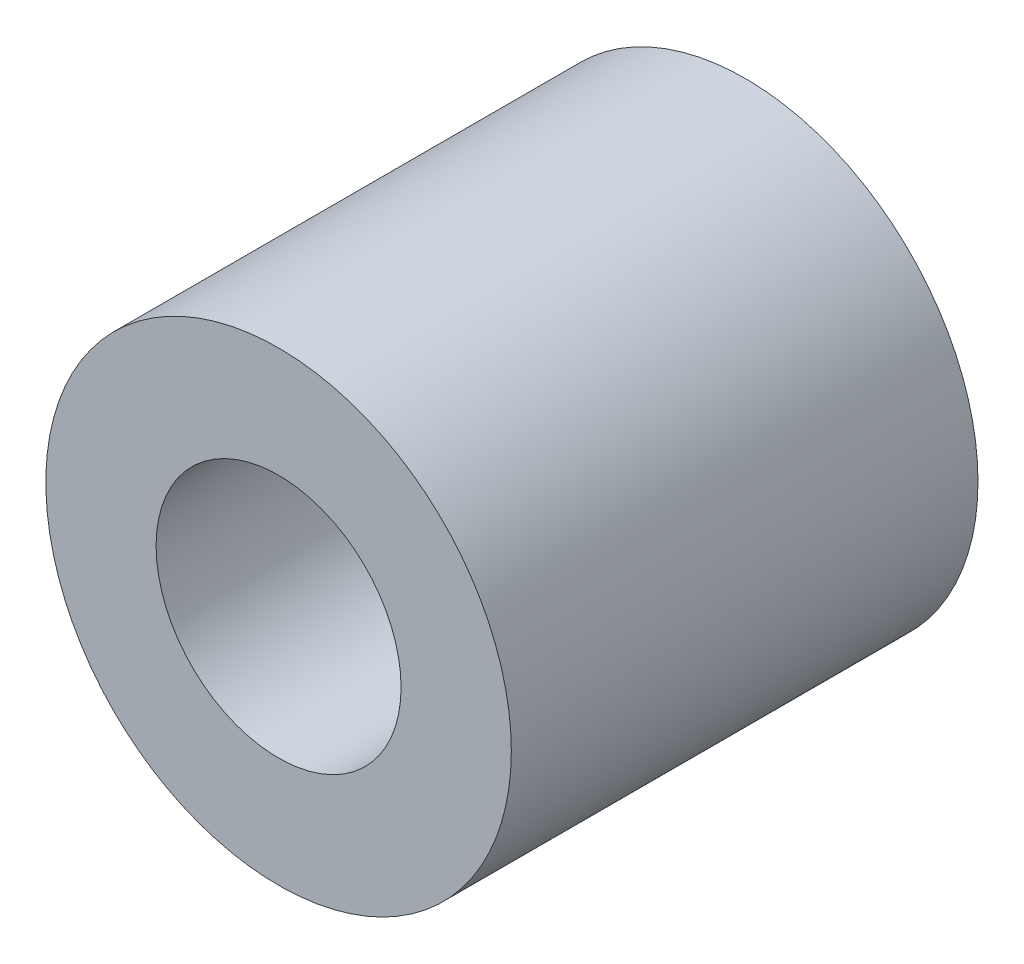
ISO-10303-21;
HEADER;
FILE_DESCRIPTION(('STEP AP214'),'2;1');
FILE_NAME('part.step','',(''),(''),'','','');
FILE_SCHEMA(('AUTOMOTIVE_DESIGN { 1 0 10303 214 1 1 1 1 }'));
ENDSEC;
DATA;
#1=APPLICATION_CONTEXT('core data for automotive mechanical design processes');
#2=APPLICATION_PROTOCOL_DEFINITION('international standard','automotive_design',2000,#1);
#3=PRODUCT_CONTEXT('',#1,'mechanical');
#4=PRODUCT('Part','Part','',(#3));
#5=PRODUCT_RELATED_PRODUCT_CATEGORY('part','',(#4));
#6=PRODUCT_DEFINITION_FORMATION('','',#4);
#7=PRODUCT_DEFINITION_CONTEXT('part definition',#1,'design');
#8=PRODUCT_DEFINITION('design','',#6,#7);
#9=PRODUCT_DEFINITION_SHAPE('','',#8);
#10=(LENGTH_UNIT() NAMED_UNIT(*) SI_UNIT(.MILLI.,.METRE.));
#11=(NAMED_UNIT(*) PLANE_ANGLE_UNIT() SI_UNIT($,.RADIAN.));
#12=(NAMED_UNIT(*) SI_UNIT($,.STERADIAN.) SOLID_ANGLE_UNIT());
#13=UNCERTAINTY_MEASURE_WITH_UNIT(LENGTH_MEASURE(1.E-05),#10,'distance_accuracy_value','');
#14=(GEOMETRIC_REPRESENTATION_CONTEXT(3) GLOBAL_UNCERTAINTY_ASSIGNED_CONTEXT((#13)) GLOBAL_UNIT_ASSIGNED_CONTEXT((#10,
#11,#12)) REPRESENTATION_CONTEXT('',''));
#15=CARTESIAN_POINT('',(0.,0.,0.));
#16=DIRECTION('',(0.,0.,1.));
#17=DIRECTION('',(1.,0.,0.));
#18=AXIS2_PLACEMENT_3D('',#15,#16,#17);
#19=CARTESIAN_POINT('',(0.,0.,-4.7625));
#20=DIRECTION('',(0.,0.,1.));
#21=DIRECTION('',(1.,0.,0.));
#22=AXIS2_PLACEMENT_3D('',#19,#20,#21);
#23=CYLINDRICAL_SURFACE('',#22,2.5);
#24=CARTESIAN_POINT('',(0.,0.,4.7625));
#25=DIRECTION('',(0.,0.,1.));
#26=DIRECTION('',(1.,0.,0.));
#27=AXIS2_PLACEMENT_3D('',#24,#25,#26);
#28=CIRCLE('',#27,2.5);
#29=CARTESIAN_POINT('',(2.5,0.,4.7625));
#30=VERTEX_POINT('',#29);
#31=EDGE_CURVE('E28',#30,#30,#28,.F.);
#32=ORIENTED_EDGE('',*,*,#31,.F.);
#33=EDGE_LOOP('',(#32));
#34=FACE_BOUND('',#33,.T.);
#35=CARTESIAN_POINT('',(0.,0.,-4.7625));
#36=DIRECTION('',(0.,0.,1.));
#37=DIRECTION('',(1.,0.,0.));
#38=AXIS2_PLACEMENT_3D('',#35,#36,#37);
#39=CIRCLE('',#38,2.5);
#40=CARTESIAN_POINT('',(2.5,0.,-4.7625));
#41=VERTEX_POINT('',#40);
#42=EDGE_CURVE('E19',#41,#41,#39,.F.);
#43=ORIENTED_EDGE('',*,*,#42,.T.);
#44=EDGE_LOOP('',(#43));
#45=FACE_BOUND('',#44,.T.);
#46=ADVANCED_FACE('F16',(#34,#45),#23,.F.);
#47=CARTESIAN_POINT('',(0.,0.,-4.7625));
#48=DIRECTION('',(0.,0.,1.));
#49=DIRECTION('',(1.,0.,0.));
#50=AXIS2_PLACEMENT_3D('',#47,#48,#49);
#51=PLANE('',#50);
#52=ORIENTED_EDGE('',*,*,#42,.F.);
#53=EDGE_LOOP('',(#52));
#54=FACE_BOUND('',#53,.T.);
#55=CARTESIAN_POINT('',(0.,0.,-4.7625));
#56=DIRECTION('',(0.,0.,1.));
#57=DIRECTION('',(1.,0.,0.));
#58=AXIS2_PLACEMENT_3D('',#55,#56,#57);
#59=CIRCLE('',#58,4.75);
#60=CARTESIAN_POINT('',(4.75,0.,-4.7625));
#61=VERTEX_POINT('',#60);
#62=EDGE_CURVE('E23',#61,#61,#59,.T.);
#63=ORIENTED_EDGE('',*,*,#62,.F.);
#64=EDGE_LOOP('',(#63));
#65=FACE_BOUND('',#64,.T.);
#66=ADVANCED_FACE('F37',(#54,#65),#51,.F.);
#67=CARTESIAN_POINT('',(0.,0.,4.7625));
#68=DIRECTION('',(0.,0.,1.));
#69=DIRECTION('',(1.,0.,0.));
#70=AXIS2_PLACEMENT_3D('',#67,#68,#69);
#71=PLANE('',#70);
#72=ORIENTED_EDGE('',*,*,#31,.T.);
#73=EDGE_LOOP('',(#72));
#74=FACE_BOUND('',#73,.T.);
#75=CARTESIAN_POINT('',(0.,0.,4.7625));
#76=DIRECTION('',(0.,0.,1.));
#77=DIRECTION('',(1.,0.,0.));
#78=AXIS2_PLACEMENT_3D('',#75,#76,#77);
#79=CIRCLE('',#78,4.75);
#80=CARTESIAN_POINT('',(4.75,0.,4.7625));
#81=VERTEX_POINT('',#80);
#82=EDGE_CURVE('E10',#81,#81,#79,.F.);
#83=ORIENTED_EDGE('',*,*,#82,.F.);
#84=EDGE_LOOP('',(#83));
#85=FACE_BOUND('',#84,.T.);
#86=ADVANCED_FACE('F40',(#74,#85),#71,.T.);
#87=CARTESIAN_POINT('',(0.,0.,-4.7625));
#88=DIRECTION('',(0.,0.,1.));
#89=DIRECTION('',(1.,0.,0.));
#90=AXIS2_PLACEMENT_3D('',#87,#88,#89);
#91=CYLINDRICAL_SURFACE('',#90,4.75);
#92=ORIENTED_EDGE('',*,*,#82,.T.);
#93=EDGE_LOOP('',(#92));
#94=FACE_BOUND('',#93,.T.);
#95=ORIENTED_EDGE('',*,*,#62,.T.);
#96=EDGE_LOOP('',(#95));
#97=FACE_BOUND('',#96,.T.);
#98=ADVANCED_FACE('F43',(#94,#97),#91,.T.);
#99=CLOSED_SHELL('',(#46,#66,#86,#98));
#100=MANIFOLD_SOLID_BREP('B1',#99);
#101=ADVANCED_BREP_SHAPE_REPRESENTATION('',(#18,#100),#14);
#102=SHAPE_DEFINITION_REPRESENTATION(#9,#101);
ENDSEC;
END-ISO-10303-21;
